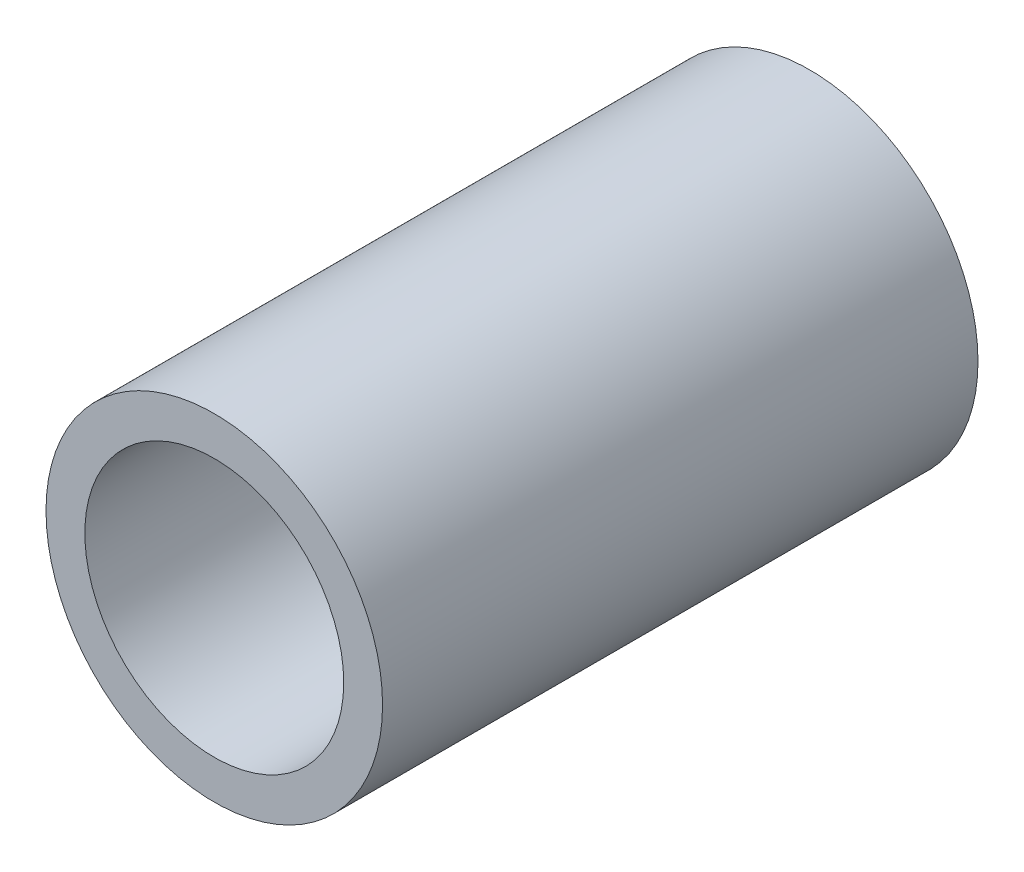
ISO-10303-21;
HEADER;
FILE_DESCRIPTION(('STEP AP214'),'2;1');
FILE_NAME('part.step','',(''),(''),'','','');
FILE_SCHEMA(('AUTOMOTIVE_DESIGN { 1 0 10303 214 1 1 1 1 }'));
ENDSEC;
DATA;
#1=APPLICATION_CONTEXT('core data for automotive mechanical design processes');
#2=APPLICATION_PROTOCOL_DEFINITION('international standard','automotive_design',2000,#1);
#3=PRODUCT_CONTEXT('',#1,'mechanical');
#4=PRODUCT('Part','Part','',(#3));
#5=PRODUCT_RELATED_PRODUCT_CATEGORY('part','',(#4));
#6=PRODUCT_DEFINITION_FORMATION('','',#4);
#7=PRODUCT_DEFINITION_CONTEXT('part definition',#1,'design');
#8=PRODUCT_DEFINITION('design','',#6,#7);
#9=PRODUCT_DEFINITION_SHAPE('','',#8);
#10=(LENGTH_UNIT() NAMED_UNIT(*) SI_UNIT(.MILLI.,.METRE.));
#11=(NAMED_UNIT(*) PLANE_ANGLE_UNIT() SI_UNIT($,.RADIAN.));
#12=(NAMED_UNIT(*) SI_UNIT($,.STERADIAN.) SOLID_ANGLE_UNIT());
#13=UNCERTAINTY_MEASURE_WITH_UNIT(LENGTH_MEASURE(1.E-05),#10,'distance_accuracy_value','');
#14=(GEOMETRIC_REPRESENTATION_CONTEXT(3) GLOBAL_UNCERTAINTY_ASSIGNED_CONTEXT((#13)) GLOBAL_UNIT_ASSIGNED_CONTEXT((#10,
#11,#12)) REPRESENTATION_CONTEXT('',''));
#15=CARTESIAN_POINT('',(0.,0.,0.));
#16=DIRECTION('',(0.,0.,1.));
#17=DIRECTION('',(1.,0.,0.));
#18=AXIS2_PLACEMENT_3D('',#15,#16,#17);
#19=CARTESIAN_POINT('',(0.,0.,34.5));
#20=DIRECTION('',(0.,0.,1.));
#21=DIRECTION('',(1.,0.,0.));
#22=AXIS2_PLACEMENT_3D('',#19,#20,#21);
#23=PLANE('',#22);
#24=CARTESIAN_POINT('',(0.,0.,34.5));
#25=DIRECTION('',(0.,0.,1.));
#26=DIRECTION('',(1.,0.,0.));
#27=AXIS2_PLACEMENT_3D('',#24,#25,#26);
#28=CIRCLE('',#27,19.5);
#29=CARTESIAN_POINT('',(19.5,0.,34.5));
#30=VERTEX_POINT('',#29);
#31=EDGE_CURVE('E10',#30,#30,#28,.T.);
#32=ORIENTED_EDGE('',*,*,#31,.T.);
#33=EDGE_LOOP('',(#32));
#34=FACE_BOUND('',#33,.T.);
#35=CARTESIAN_POINT('',(0.,0.,34.5));
#36=DIRECTION('',(0.,0.,1.));
#37=DIRECTION('',(1.,0.,0.));
#38=AXIS2_PLACEMENT_3D('',#35,#36,#37);
#39=CIRCLE('',#38,15.);
#40=CARTESIAN_POINT('',(15.,0.,34.5));
#41=VERTEX_POINT('',#40);
#42=EDGE_CURVE('E50',#41,#41,#39,.T.);
#43=ORIENTED_EDGE('',*,*,#42,.F.);
#44=EDGE_LOOP('',(#43));
#45=FACE_BOUND('',#44,.T.);
#46=ADVANCED_FACE('F37',(#34,#45),#23,.T.);
#47=CARTESIAN_POINT('',(0.,0.,-34.5));
#48=DIRECTION('',(0.,0.,1.));
#49=DIRECTION('',(1.,0.,0.));
#50=AXIS2_PLACEMENT_3D('',#47,#48,#49);
#51=PLANE('',#50);
#52=CARTESIAN_POINT('',(0.,0.,-34.5));
#53=DIRECTION('',(0.,0.,1.));
#54=DIRECTION('',(1.,0.,0.));
#55=AXIS2_PLACEMENT_3D('',#52,#53,#54);
#56=CIRCLE('',#55,19.5);
#57=CARTESIAN_POINT('',(19.5,0.,-34.5));
#58=VERTEX_POINT('',#57);
#59=EDGE_CURVE('E41',#58,#58,#56,.T.);
#60=ORIENTED_EDGE('',*,*,#59,.F.);
#61=EDGE_LOOP('',(#60));
#62=FACE_BOUND('',#61,.T.);
#63=CARTESIAN_POINT('',(0.,0.,-34.5));
#64=DIRECTION('',(0.,0.,1.));
#65=DIRECTION('',(1.,0.,0.));
#66=AXIS2_PLACEMENT_3D('',#63,#64,#65);
#67=CIRCLE('',#66,15.);
#68=CARTESIAN_POINT('',(15.,0.,-34.5));
#69=VERTEX_POINT('',#68);
#70=EDGE_CURVE('E52',#69,#69,#67,.T.);
#71=ORIENTED_EDGE('',*,*,#70,.T.);
#72=EDGE_LOOP('',(#71));
#73=FACE_BOUND('',#72,.T.);
#74=ADVANCED_FACE('F64',(#62,#73),#51,.F.);
#75=CARTESIAN_POINT('',(0.,0.,34.5));
#76=DIRECTION('',(0.,0.,-1.));
#77=DIRECTION('',(-1.,0.,0.));
#78=AXIS2_PLACEMENT_3D('',#75,#76,#77);
#79=CYLINDRICAL_SURFACE('',#78,19.5);
#80=ORIENTED_EDGE('',*,*,#31,.F.);
#81=EDGE_LOOP('',(#80));
#82=FACE_BOUND('',#81,.T.);
#83=ORIENTED_EDGE('',*,*,#59,.T.);
#84=EDGE_LOOP('',(#83));
#85=FACE_BOUND('',#84,.T.);
#86=ADVANCED_FACE('F39',(#82,#85),#79,.T.);
#87=CARTESIAN_POINT('',(0.,0.,34.5));
#88=DIRECTION('',(0.,0.,-1.));
#89=DIRECTION('',(-1.,0.,0.));
#90=AXIS2_PLACEMENT_3D('',#87,#88,#89);
#91=CYLINDRICAL_SURFACE('',#90,15.);
#92=ORIENTED_EDGE('',*,*,#42,.T.);
#93=EDGE_LOOP('',(#92));
#94=FACE_BOUND('',#93,.T.);
#95=ORIENTED_EDGE('',*,*,#70,.F.);
#96=EDGE_LOOP('',(#95));
#97=FACE_BOUND('',#96,.T.);
#98=ADVANCED_FACE('F60',(#94,#97),#91,.F.);
#99=CLOSED_SHELL('',(#46,#74,#86,#98));
#100=MANIFOLD_SOLID_BREP('B2',#99);
#101=ADVANCED_BREP_SHAPE_REPRESENTATION('',(#18,#100),#14);
#102=SHAPE_DEFINITION_REPRESENTATION(#9,#101);
ENDSEC;
END-ISO-10303-21;
